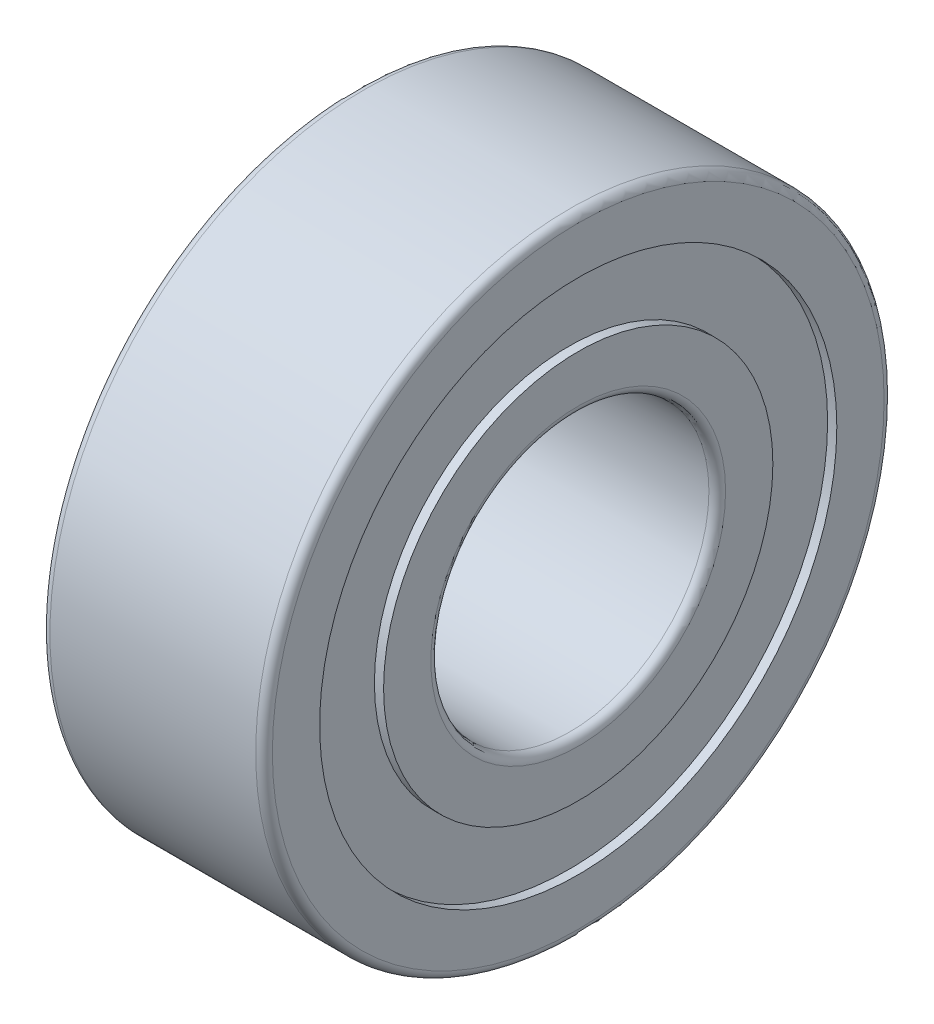
ISO-10303-21;
HEADER;
FILE_DESCRIPTION(('STEP AP214'),'2;1');
FILE_NAME('part.step','',(''),(''),'','','');
FILE_SCHEMA(('AUTOMOTIVE_DESIGN { 1 0 10303 214 1 1 1 1 }'));
ENDSEC;
DATA;
#1=APPLICATION_CONTEXT('core data for automotive mechanical design processes');
#2=APPLICATION_PROTOCOL_DEFINITION('international standard','automotive_design',2000,#1);
#3=PRODUCT_CONTEXT('',#1,'mechanical');
#4=PRODUCT('Part','Part','',(#3));
#5=PRODUCT_RELATED_PRODUCT_CATEGORY('part','',(#4));
#6=PRODUCT_DEFINITION_FORMATION('','',#4);
#7=PRODUCT_DEFINITION_CONTEXT('part definition',#1,'design');
#8=PRODUCT_DEFINITION('design','',#6,#7);
#9=PRODUCT_DEFINITION_SHAPE('','',#8);
#10=(LENGTH_UNIT() NAMED_UNIT(*) SI_UNIT(.MILLI.,.METRE.));
#11=(NAMED_UNIT(*) PLANE_ANGLE_UNIT() SI_UNIT($,.RADIAN.));
#12=(NAMED_UNIT(*) SI_UNIT($,.STERADIAN.) SOLID_ANGLE_UNIT());
#13=UNCERTAINTY_MEASURE_WITH_UNIT(LENGTH_MEASURE(1.E-05),#10,'distance_accuracy_value','');
#14=(GEOMETRIC_REPRESENTATION_CONTEXT(3) GLOBAL_UNCERTAINTY_ASSIGNED_CONTEXT((#13)) GLOBAL_UNIT_ASSIGNED_CONTEXT((#10,
#11,#12)) REPRESENTATION_CONTEXT('',''));
#15=CARTESIAN_POINT('',(0.,0.,0.));
#16=DIRECTION('',(0.,0.,1.));
#17=DIRECTION('',(1.,0.,0.));
#18=AXIS2_PLACEMENT_3D('',#15,#16,#17);
#19=CARTESIAN_POINT('',(-0.00250000000000072,0.,0.));
#20=DIRECTION('',(1.,0.,0.));
#21=DIRECTION('',(0.,0.,-1.));
#22=AXIS2_PLACEMENT_3D('',#19,#20,#21);
#23=CYLINDRICAL_SURFACE('',#22,3.5);
#24=CARTESIAN_POINT('',(0.,0.,0.));
#25=DIRECTION('',(1.,0.,0.));
#26=DIRECTION('',(0.,0.,-1.));
#27=AXIS2_PLACEMENT_3D('',#24,#25,#26);
#28=CIRCLE('',#27,3.5);
#29=CARTESIAN_POINT('',(0.,0.,-3.5));
#30=VERTEX_POINT('',#29);
#31=EDGE_CURVE('E10',#30,#30,#28,.T.);
#32=ORIENTED_EDGE('',*,*,#31,.T.);
#33=EDGE_LOOP('',(#32));
#34=FACE_BOUND('',#33,.T.);
#35=CARTESIAN_POINT('',(0.1655,0.,0.));
#36=DIRECTION('',(1.,0.,0.));
#37=DIRECTION('',(0.,0.,-1.));
#38=AXIS2_PLACEMENT_3D('',#35,#36,#37);
#39=CIRCLE('',#38,3.5);
#40=CARTESIAN_POINT('',(0.1655,0.,-3.5));
#41=VERTEX_POINT('',#40);
#42=EDGE_CURVE('E83',#41,#41,#39,.T.);
#43=ORIENTED_EDGE('',*,*,#42,.F.);
#44=EDGE_LOOP('',(#43));
#45=FACE_BOUND('',#44,.T.);
#46=ADVANCED_FACE('F31',(#34,#45),#23,.T.);
#47=CARTESIAN_POINT('',(0.,3.5,0.));
#48=DIRECTION('',(-1.,0.,0.));
#49=DIRECTION('',(0.,0.,1.));
#50=AXIS2_PLACEMENT_3D('',#47,#48,#49);
#51=PLANE('',#50);
#52=CARTESIAN_POINT('',(0.,0.,0.));
#53=DIRECTION('',(1.,0.,0.));
#54=DIRECTION('',(0.,0.,-1.));
#55=AXIS2_PLACEMENT_3D('',#52,#53,#54);
#56=CIRCLE('',#55,2.65);
#57=CARTESIAN_POINT('',(0.,0.,-2.65));
#58=VERTEX_POINT('',#57);
#59=EDGE_CURVE('E37',#58,#58,#56,.T.);
#60=ORIENTED_EDGE('',*,*,#59,.T.);
#61=EDGE_LOOP('',(#60));
#62=FACE_BOUND('',#61,.T.);
#63=ORIENTED_EDGE('',*,*,#31,.F.);
#64=EDGE_LOOP('',(#63));
#65=FACE_BOUND('',#64,.T.);
#66=ADVANCED_FACE('F91',(#62,#65),#51,.T.);
#67=CARTESIAN_POINT('',(0.14999999999997,0.,0.));
#68=DIRECTION('',(1.,0.,0.));
#69=DIRECTION('',(0.,0.,-1.));
#70=AXIS2_PLACEMENT_3D('',#67,#68,#69);
#71=TOROIDAL_SURFACE('',#70,2.64999999999997,0.14999999999997);
#72=CARTESIAN_POINT('',(0.15,0.,0.));
#73=DIRECTION('',(1.,0.,0.));
#74=DIRECTION('',(0.,0.,-1.));
#75=AXIS2_PLACEMENT_3D('',#72,#73,#74);
#76=CIRCLE('',#75,2.5);
#77=CARTESIAN_POINT('',(0.15,0.,-2.5));
#78=VERTEX_POINT('',#77);
#79=EDGE_CURVE('E41',#78,#78,#76,.T.);
#80=ORIENTED_EDGE('',*,*,#79,.T.);
#81=EDGE_LOOP('',(#80));
#82=FACE_BOUND('',#81,.T.);
#83=ORIENTED_EDGE('',*,*,#59,.F.);
#84=EDGE_LOOP('',(#83));
#85=FACE_BOUND('',#84,.T.);
#86=ADVANCED_FACE('F95',(#82,#85),#71,.T.);
#87=CARTESIAN_POINT('',(-0.00250000000000072,0.,0.));
#88=DIRECTION('',(1.,0.,0.));
#89=DIRECTION('',(0.,0.,-1.));
#90=AXIS2_PLACEMENT_3D('',#87,#88,#89);
#91=CYLINDRICAL_SURFACE('',#90,2.5);
#92=CARTESIAN_POINT('',(3.85000000000007,0.,0.));
#93=DIRECTION('',(1.,0.,0.));
#94=DIRECTION('',(0.,0.,-1.));
#95=AXIS2_PLACEMENT_3D('',#92,#93,#94);
#96=CIRCLE('',#95,2.5);
#97=CARTESIAN_POINT('',(3.85000000000007,0.,-2.5));
#98=VERTEX_POINT('',#97);
#99=EDGE_CURVE('E45',#98,#98,#96,.T.);
#100=ORIENTED_EDGE('',*,*,#99,.T.);
#101=EDGE_LOOP('',(#100));
#102=FACE_BOUND('',#101,.T.);
#103=ORIENTED_EDGE('',*,*,#79,.F.);
#104=EDGE_LOOP('',(#103));
#105=FACE_BOUND('',#104,.T.);
#106=ADVANCED_FACE('F99',(#102,#105),#91,.F.);
#107=CARTESIAN_POINT('',(3.85000000000006,0.,0.));
#108=DIRECTION('',(1.,0.,0.));
#109=DIRECTION('',(0.,0.,-1.));
#110=AXIS2_PLACEMENT_3D('',#107,#108,#109);
#111=TOROIDAL_SURFACE('',#110,2.64999999999994,0.149999999999939);
#112=CARTESIAN_POINT('',(4.,0.,0.));
#113=DIRECTION('',(1.,0.,0.));
#114=DIRECTION('',(0.,0.,-1.));
#115=AXIS2_PLACEMENT_3D('',#112,#113,#114);
#116=CIRCLE('',#115,2.64999999999994);
#117=CARTESIAN_POINT('',(4.,0.,-2.64999999999994));
#118=VERTEX_POINT('',#117);
#119=EDGE_CURVE('E50',#118,#118,#116,.T.);
#120=ORIENTED_EDGE('',*,*,#119,.T.);
#121=EDGE_LOOP('',(#120));
#122=FACE_BOUND('',#121,.T.);
#123=ORIENTED_EDGE('',*,*,#99,.F.);
#124=EDGE_LOOP('',(#123));
#125=FACE_BOUND('',#124,.T.);
#126=ADVANCED_FACE('F106',(#122,#125),#111,.T.);
#127=CARTESIAN_POINT('',(4.00000000000001,2.64999999999994,0.));
#128=DIRECTION('',(1.,0.,0.));
#129=DIRECTION('',(0.,0.,-1.));
#130=AXIS2_PLACEMENT_3D('',#127,#128,#129);
#131=PLANE('',#130);
#132=CARTESIAN_POINT('',(4.00000000000001,0.,0.));
#133=DIRECTION('',(1.,0.,0.));
#134=DIRECTION('',(0.,0.,-1.));
#135=AXIS2_PLACEMENT_3D('',#132,#133,#134);
#136=CIRCLE('',#135,3.5);
#137=CARTESIAN_POINT('',(4.00000000000001,0.,-3.5));
#138=VERTEX_POINT('',#137);
#139=EDGE_CURVE('E53',#138,#138,#136,.T.);
#140=ORIENTED_EDGE('',*,*,#139,.T.);
#141=EDGE_LOOP('',(#140));
#142=FACE_BOUND('',#141,.T.);
#143=ORIENTED_EDGE('',*,*,#119,.F.);
#144=EDGE_LOOP('',(#143));
#145=FACE_BOUND('',#144,.T.);
#146=ADVANCED_FACE('F110',(#142,#145),#131,.T.);
#147=CARTESIAN_POINT('',(-0.00250000000000072,0.,0.));
#148=DIRECTION('',(1.,0.,0.));
#149=DIRECTION('',(0.,0.,-1.));
#150=AXIS2_PLACEMENT_3D('',#147,#148,#149);
#151=CYLINDRICAL_SURFACE('',#150,3.5);
#152=CARTESIAN_POINT('',(3.8345,0.,0.));
#153=DIRECTION('',(1.,0.,0.));
#154=DIRECTION('',(0.,0.,-1.));
#155=AXIS2_PLACEMENT_3D('',#152,#153,#154);
#156=CIRCLE('',#155,3.5);
#157=CARTESIAN_POINT('',(3.8345,0.,-3.5));
#158=VERTEX_POINT('',#157);
#159=EDGE_CURVE('E56',#158,#158,#156,.T.);
#160=ORIENTED_EDGE('',*,*,#159,.T.);
#161=EDGE_LOOP('',(#160));
#162=FACE_BOUND('',#161,.T.);
#163=ORIENTED_EDGE('',*,*,#139,.F.);
#164=EDGE_LOOP('',(#163));
#165=FACE_BOUND('',#164,.T.);
#166=ADVANCED_FACE('F114',(#162,#165),#151,.T.);
#167=CARTESIAN_POINT('',(3.8345,3.5,0.));
#168=DIRECTION('',(1.,0.,0.));
#169=DIRECTION('',(0.,0.,-1.));
#170=AXIS2_PLACEMENT_3D('',#167,#168,#169);
#171=PLANE('',#170);
#172=CARTESIAN_POINT('',(3.8345,0.,0.));
#173=DIRECTION('',(1.,0.,0.));
#174=DIRECTION('',(0.,0.,-1.));
#175=AXIS2_PLACEMENT_3D('',#172,#173,#174);
#176=CIRCLE('',#175,4.65);
#177=CARTESIAN_POINT('',(3.8345,0.,-4.65));
#178=VERTEX_POINT('',#177);
#179=EDGE_CURVE('E59',#178,#178,#176,.T.);
#180=ORIENTED_EDGE('',*,*,#179,.T.);
#181=EDGE_LOOP('',(#180));
#182=FACE_BOUND('',#181,.T.);
#183=ORIENTED_EDGE('',*,*,#159,.F.);
#184=EDGE_LOOP('',(#183));
#185=FACE_BOUND('',#184,.T.);
#186=ADVANCED_FACE('F118',(#182,#185),#171,.T.);
#187=CARTESIAN_POINT('',(-0.00250000000000072,0.,0.));
#188=DIRECTION('',(1.,0.,0.));
#189=DIRECTION('',(0.,0.,-1.));
#190=AXIS2_PLACEMENT_3D('',#187,#188,#189);
#191=CYLINDRICAL_SURFACE('',#190,4.65);
#192=CARTESIAN_POINT('',(4.00000000000001,0.,0.));
#193=DIRECTION('',(1.,0.,0.));
#194=DIRECTION('',(0.,0.,-1.));
#195=AXIS2_PLACEMENT_3D('',#192,#193,#194);
#196=CIRCLE('',#195,4.65);
#197=CARTESIAN_POINT('',(4.00000000000001,0.,-4.65));
#198=VERTEX_POINT('',#197);
#199=EDGE_CURVE('E62',#198,#198,#196,.T.);
#200=ORIENTED_EDGE('',*,*,#199,.T.);
#201=EDGE_LOOP('',(#200));
#202=FACE_BOUND('',#201,.T.);
#203=ORIENTED_EDGE('',*,*,#179,.F.);
#204=EDGE_LOOP('',(#203));
#205=FACE_BOUND('',#204,.T.);
#206=ADVANCED_FACE('F122',(#202,#205),#191,.F.);
#207=CARTESIAN_POINT('',(4.00000000000001,4.65,0.));
#208=DIRECTION('',(1.,0.,0.));
#209=DIRECTION('',(0.,0.,-1.));
#210=AXIS2_PLACEMENT_3D('',#207,#208,#209);
#211=PLANE('',#210);
#212=CARTESIAN_POINT('',(4.00000000000001,0.,0.));
#213=DIRECTION('',(1.,0.,0.));
#214=DIRECTION('',(0.,0.,-1.));
#215=AXIS2_PLACEMENT_3D('',#212,#213,#214);
#216=CIRCLE('',#215,5.50000000000006);
#217=CARTESIAN_POINT('',(4.00000000000001,0.,-5.50000000000006));
#218=VERTEX_POINT('',#217);
#219=EDGE_CURVE('E65',#218,#218,#216,.T.);
#220=ORIENTED_EDGE('',*,*,#219,.T.);
#221=EDGE_LOOP('',(#220));
#222=FACE_BOUND('',#221,.T.);
#223=ORIENTED_EDGE('',*,*,#199,.F.);
#224=EDGE_LOOP('',(#223));
#225=FACE_BOUND('',#224,.T.);
#226=ADVANCED_FACE('F126',(#222,#225),#211,.T.);
#227=CARTESIAN_POINT('',(3.85000000000007,0.,0.));
#228=DIRECTION('',(1.,0.,0.));
#229=DIRECTION('',(0.,0.,-1.));
#230=AXIS2_PLACEMENT_3D('',#227,#228,#229);
#231=TOROIDAL_SURFACE('',#230,5.50000000000006,0.149999999999939);
#232=CARTESIAN_POINT('',(3.85000000000007,0.,0.));
#233=DIRECTION('',(1.,0.,0.));
#234=DIRECTION('',(0.,0.,-1.));
#235=AXIS2_PLACEMENT_3D('',#232,#233,#234);
#236=CIRCLE('',#235,5.65);
#237=CARTESIAN_POINT('',(3.85000000000007,0.,-5.65));
#238=VERTEX_POINT('',#237);
#239=EDGE_CURVE('E68',#238,#238,#236,.T.);
#240=ORIENTED_EDGE('',*,*,#239,.T.);
#241=EDGE_LOOP('',(#240));
#242=FACE_BOUND('',#241,.T.);
#243=ORIENTED_EDGE('',*,*,#219,.F.);
#244=EDGE_LOOP('',(#243));
#245=FACE_BOUND('',#244,.T.);
#246=ADVANCED_FACE('F130',(#242,#245),#231,.T.);
#247=CARTESIAN_POINT('',(-0.00250000000000072,0.,0.));
#248=DIRECTION('',(1.,0.,0.));
#249=DIRECTION('',(0.,0.,-1.));
#250=AXIS2_PLACEMENT_3D('',#247,#248,#249);
#251=CYLINDRICAL_SURFACE('',#250,5.65);
#252=CARTESIAN_POINT('',(0.149999999999985,0.,0.));
#253=DIRECTION('',(1.,0.,0.));
#254=DIRECTION('',(0.,0.,-1.));
#255=AXIS2_PLACEMENT_3D('',#252,#253,#254);
#256=CIRCLE('',#255,5.65);
#257=CARTESIAN_POINT('',(0.149999999999985,0.,-5.65));
#258=VERTEX_POINT('',#257);
#259=EDGE_CURVE('E71',#258,#258,#256,.T.);
#260=ORIENTED_EDGE('',*,*,#259,.T.);
#261=EDGE_LOOP('',(#260));
#262=FACE_BOUND('',#261,.T.);
#263=ORIENTED_EDGE('',*,*,#239,.F.);
#264=EDGE_LOOP('',(#263));
#265=FACE_BOUND('',#264,.T.);
#266=ADVANCED_FACE('F134',(#262,#265),#251,.T.);
#267=CARTESIAN_POINT('',(0.149999999999985,0.,0.));
#268=DIRECTION('',(1.,0.,0.));
#269=DIRECTION('',(0.,0.,-1.));
#270=AXIS2_PLACEMENT_3D('',#267,#268,#269);
#271=TOROIDAL_SURFACE('',#270,5.50000000000002,0.149999999999985);
#272=CARTESIAN_POINT('',(0.,0.,0.));
#273=DIRECTION('',(1.,0.,0.));
#274=DIRECTION('',(0.,0.,-1.));
#275=AXIS2_PLACEMENT_3D('',#272,#273,#274);
#276=CIRCLE('',#275,5.50000000000002);
#277=CARTESIAN_POINT('',(0.,0.,-5.50000000000002));
#278=VERTEX_POINT('',#277);
#279=EDGE_CURVE('E74',#278,#278,#276,.T.);
#280=ORIENTED_EDGE('',*,*,#279,.T.);
#281=EDGE_LOOP('',(#280));
#282=FACE_BOUND('',#281,.T.);
#283=ORIENTED_EDGE('',*,*,#259,.F.);
#284=EDGE_LOOP('',(#283));
#285=FACE_BOUND('',#284,.T.);
#286=ADVANCED_FACE('F138',(#282,#285),#271,.T.);
#287=CARTESIAN_POINT('',(0.,5.50000000000002,0.));
#288=DIRECTION('',(-1.,0.,0.));
#289=DIRECTION('',(0.,0.,1.));
#290=AXIS2_PLACEMENT_3D('',#287,#288,#289);
#291=PLANE('',#290);
#292=CARTESIAN_POINT('',(0.,0.,0.));
#293=DIRECTION('',(1.,0.,0.));
#294=DIRECTION('',(0.,0.,-1.));
#295=AXIS2_PLACEMENT_3D('',#292,#293,#294);
#296=CIRCLE('',#295,4.65);
#297=CARTESIAN_POINT('',(0.,0.,-4.65));
#298=VERTEX_POINT('',#297);
#299=EDGE_CURVE('E77',#298,#298,#296,.T.);
#300=ORIENTED_EDGE('',*,*,#299,.T.);
#301=EDGE_LOOP('',(#300));
#302=FACE_BOUND('',#301,.T.);
#303=ORIENTED_EDGE('',*,*,#279,.F.);
#304=EDGE_LOOP('',(#303));
#305=FACE_BOUND('',#304,.T.);
#306=ADVANCED_FACE('F142',(#302,#305),#291,.T.);
#307=CARTESIAN_POINT('',(-0.00250000000000072,0.,0.));
#308=DIRECTION('',(1.,0.,0.));
#309=DIRECTION('',(0.,0.,-1.));
#310=AXIS2_PLACEMENT_3D('',#307,#308,#309);
#311=CYLINDRICAL_SURFACE('',#310,4.65);
#312=CARTESIAN_POINT('',(0.1655,0.,0.));
#313=DIRECTION('',(1.,0.,0.));
#314=DIRECTION('',(0.,0.,-1.));
#315=AXIS2_PLACEMENT_3D('',#312,#313,#314);
#316=CIRCLE('',#315,4.65);
#317=CARTESIAN_POINT('',(0.1655,0.,-4.65));
#318=VERTEX_POINT('',#317);
#319=EDGE_CURVE('E80',#318,#318,#316,.T.);
#320=ORIENTED_EDGE('',*,*,#319,.T.);
#321=EDGE_LOOP('',(#320));
#322=FACE_BOUND('',#321,.T.);
#323=ORIENTED_EDGE('',*,*,#299,.F.);
#324=EDGE_LOOP('',(#323));
#325=FACE_BOUND('',#324,.T.);
#326=ADVANCED_FACE('F146',(#322,#325),#311,.F.);
#327=CARTESIAN_POINT('',(0.1655,4.65,0.));
#328=DIRECTION('',(-1.,0.,0.));
#329=DIRECTION('',(0.,0.,1.));
#330=AXIS2_PLACEMENT_3D('',#327,#328,#329);
#331=PLANE('',#330);
#332=ORIENTED_EDGE('',*,*,#42,.T.);
#333=EDGE_LOOP('',(#332));
#334=FACE_BOUND('',#333,.T.);
#335=ORIENTED_EDGE('',*,*,#319,.F.);
#336=EDGE_LOOP('',(#335));
#337=FACE_BOUND('',#336,.T.);
#338=ADVANCED_FACE('F87',(#334,#337),#331,.T.);
#339=CLOSED_SHELL('',(#46,#66,#86,#106,#126,#146,#166,#186,#206,#226,#246,#266,#286,#306,#326,#338));
#340=MANIFOLD_SOLID_BREP('B2',#339);
#341=ADVANCED_BREP_SHAPE_REPRESENTATION('',(#18,#340),#14);
#342=SHAPE_DEFINITION_REPRESENTATION(#9,#341);
ENDSEC;
END-ISO-10303-21;
